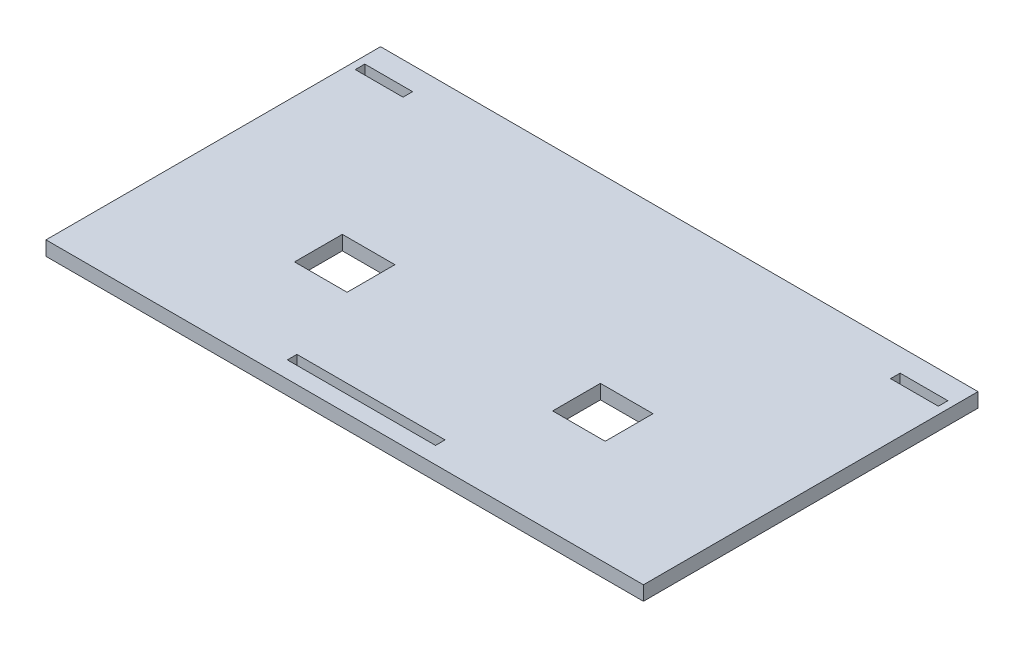
ISO-10303-21;
HEADER;
FILE_DESCRIPTION(('STEP AP214'),'2;1');
FILE_NAME('part.step','',(''),(''),'','','');
FILE_SCHEMA(('AUTOMOTIVE_DESIGN { 1 0 10303 214 1 1 1 1 }'));
ENDSEC;
DATA;
#1=APPLICATION_CONTEXT('core data for automotive mechanical design processes');
#2=APPLICATION_PROTOCOL_DEFINITION('international standard','automotive_design',2000,#1);
#3=PRODUCT_CONTEXT('',#1,'mechanical');
#4=PRODUCT('Part','Part','',(#3));
#5=PRODUCT_RELATED_PRODUCT_CATEGORY('part','',(#4));
#6=PRODUCT_DEFINITION_FORMATION('','',#4);
#7=PRODUCT_DEFINITION_CONTEXT('part definition',#1,'design');
#8=PRODUCT_DEFINITION('design','',#6,#7);
#9=PRODUCT_DEFINITION_SHAPE('','',#8);
#10=(LENGTH_UNIT() NAMED_UNIT(*) SI_UNIT(.MILLI.,.METRE.));
#11=(NAMED_UNIT(*) PLANE_ANGLE_UNIT() SI_UNIT($,.RADIAN.));
#12=(NAMED_UNIT(*) SI_UNIT($,.STERADIAN.) SOLID_ANGLE_UNIT());
#13=UNCERTAINTY_MEASURE_WITH_UNIT(LENGTH_MEASURE(1.E-05),#10,'distance_accuracy_value','');
#14=(GEOMETRIC_REPRESENTATION_CONTEXT(3) GLOBAL_UNCERTAINTY_ASSIGNED_CONTEXT((#13)) GLOBAL_UNIT_ASSIGNED_CONTEXT((#10,
#11,#12)) REPRESENTATION_CONTEXT('',''));
#15=CARTESIAN_POINT('',(0.,0.,0.));
#16=DIRECTION('',(0.,0.,1.));
#17=DIRECTION('',(1.,0.,0.));
#18=AXIS2_PLACEMENT_3D('',#15,#16,#17);
#19=CARTESIAN_POINT('',(-62.5,3.,-35.));
#20=DIRECTION('',(1.,0.,0.));
#21=DIRECTION('',(0.,0.,-1.));
#22=AXIS2_PLACEMENT_3D('',#19,#20,#21);
#23=PLANE('',#22);
#24=DIRECTION('',(0.,0.,1.));
#25=VECTOR('',#24,1.);
#26=CARTESIAN_POINT('',(-62.5,0.,-35.));
#27=LINE('',#26,#25);
#28=CARTESIAN_POINT('',(-62.5,0.,-35.));
#29=VERTEX_POINT('',#28);
#30=CARTESIAN_POINT('',(-62.5,0.,35.));
#31=VERTEX_POINT('',#30);
#32=EDGE_CURVE('E317',#29,#31,#27,.T.);
#33=ORIENTED_EDGE('',*,*,#32,.T.);
#34=DIRECTION('',(0.,-1.,0.));
#35=VECTOR('',#34,1.);
#36=CARTESIAN_POINT('',(-62.5,3.,35.));
#37=LINE('',#36,#35);
#38=CARTESIAN_POINT('',(-62.5,3.,35.));
#39=VERTEX_POINT('',#38);
#40=EDGE_CURVE('E390',#39,#31,#37,.T.);
#41=ORIENTED_EDGE('',*,*,#40,.F.);
#42=DIRECTION('',(0.,0.,1.));
#43=VECTOR('',#42,1.);
#44=CARTESIAN_POINT('',(-62.5,3.,-35.));
#45=LINE('',#44,#43);
#46=CARTESIAN_POINT('',(-62.5,3.,-35.));
#47=VERTEX_POINT('',#46);
#48=EDGE_CURVE('E353',#47,#39,#45,.T.);
#49=ORIENTED_EDGE('',*,*,#48,.F.);
#50=DIRECTION('',(0.,-1.,0.));
#51=VECTOR('',#50,1.);
#52=CARTESIAN_POINT('',(-62.5,3.,-35.));
#53=LINE('',#52,#51);
#54=EDGE_CURVE('E367',#47,#29,#53,.T.);
#55=ORIENTED_EDGE('',*,*,#54,.T.);
#56=EDGE_LOOP('',(#33,#41,#49,#55));
#57=FACE_BOUND('',#56,.T.);
#58=ADVANCED_FACE('F42',(#57),#23,.F.);
#59=CARTESIAN_POINT('',(62.5,3.,35.));
#60=DIRECTION('',(0.,0.,-1.));
#61=DIRECTION('',(-1.,0.,0.));
#62=AXIS2_PLACEMENT_3D('',#59,#60,#61);
#63=PLANE('',#62);
#64=DIRECTION('',(1.,0.,0.));
#65=VECTOR('',#64,1.);
#66=CARTESIAN_POINT('',(62.5,0.,35.));
#67=LINE('',#66,#65);
#68=CARTESIAN_POINT('',(62.5,0.,35.));
#69=VERTEX_POINT('',#68);
#70=EDGE_CURVE('E371',#31,#69,#67,.T.);
#71=ORIENTED_EDGE('',*,*,#70,.T.);
#72=DIRECTION('',(0.,-1.,0.));
#73=VECTOR('',#72,1.);
#74=CARTESIAN_POINT('',(62.5,3.,35.));
#75=LINE('',#74,#73);
#76=CARTESIAN_POINT('',(62.5,3.,35.));
#77=VERTEX_POINT('',#76);
#78=EDGE_CURVE('E386',#77,#69,#75,.T.);
#79=ORIENTED_EDGE('',*,*,#78,.F.);
#80=DIRECTION('',(1.,0.,0.));
#81=VECTOR('',#80,1.);
#82=CARTESIAN_POINT('',(62.5,3.,35.));
#83=LINE('',#82,#81);
#84=EDGE_CURVE('E357',#39,#77,#83,.T.);
#85=ORIENTED_EDGE('',*,*,#84,.F.);
#86=ORIENTED_EDGE('',*,*,#40,.T.);
#87=EDGE_LOOP('',(#71,#79,#85,#86));
#88=FACE_BOUND('',#87,.T.);
#89=ADVANCED_FACE('F475',(#88),#63,.F.);
#90=CARTESIAN_POINT('',(62.5,3.,-35.));
#91=DIRECTION('',(-1.,0.,0.));
#92=DIRECTION('',(0.,0.,1.));
#93=AXIS2_PLACEMENT_3D('',#90,#91,#92);
#94=PLANE('',#93);
#95=DIRECTION('',(0.,0.,-1.));
#96=VECTOR('',#95,1.);
#97=CARTESIAN_POINT('',(62.5,0.,-35.));
#98=LINE('',#97,#96);
#99=CARTESIAN_POINT('',(62.5,0.,-35.));
#100=VERTEX_POINT('',#99);
#101=EDGE_CURVE('E374',#69,#100,#98,.T.);
#102=ORIENTED_EDGE('',*,*,#101,.T.);
#103=DIRECTION('',(0.,-1.,0.));
#104=VECTOR('',#103,1.);
#105=CARTESIAN_POINT('',(62.5,3.,-35.));
#106=LINE('',#105,#104);
#107=CARTESIAN_POINT('',(62.5,3.,-35.));
#108=VERTEX_POINT('',#107);
#109=EDGE_CURVE('E382',#108,#100,#106,.T.);
#110=ORIENTED_EDGE('',*,*,#109,.F.);
#111=DIRECTION('',(0.,0.,-1.));
#112=VECTOR('',#111,1.);
#113=CARTESIAN_POINT('',(62.5,3.,-35.));
#114=LINE('',#113,#112);
#115=EDGE_CURVE('E361',#77,#108,#114,.T.);
#116=ORIENTED_EDGE('',*,*,#115,.F.);
#117=ORIENTED_EDGE('',*,*,#78,.T.);
#118=EDGE_LOOP('',(#102,#110,#116,#117));
#119=FACE_BOUND('',#118,.T.);
#120=ADVANCED_FACE('F480',(#119),#94,.F.);
#121=CARTESIAN_POINT('',(62.5,3.,-35.));
#122=DIRECTION('',(0.,0.,1.));
#123=DIRECTION('',(1.,0.,0.));
#124=AXIS2_PLACEMENT_3D('',#121,#122,#123);
#125=PLANE('',#124);
#126=DIRECTION('',(-1.,0.,0.));
#127=VECTOR('',#126,1.);
#128=CARTESIAN_POINT('',(62.5,0.,-35.));
#129=LINE('',#128,#127);
#130=EDGE_CURVE('E358',#100,#29,#129,.T.);
#131=ORIENTED_EDGE('',*,*,#130,.T.);
#132=ORIENTED_EDGE('',*,*,#54,.F.);
#133=DIRECTION('',(-1.,0.,0.));
#134=VECTOR('',#133,1.);
#135=CARTESIAN_POINT('',(62.5,3.,-35.));
#136=LINE('',#135,#134);
#137=EDGE_CURVE('E364',#108,#47,#136,.T.);
#138=ORIENTED_EDGE('',*,*,#137,.F.);
#139=ORIENTED_EDGE('',*,*,#109,.T.);
#140=EDGE_LOOP('',(#131,#132,#138,#139));
#141=FACE_BOUND('',#140,.T.);
#142=ADVANCED_FACE('F495',(#141),#125,.F.);
#143=CARTESIAN_POINT('',(0.,3.,0.));
#144=DIRECTION('',(0.,-1.,0.));
#145=DIRECTION('',(0.,0.,-1.));
#146=AXIS2_PLACEMENT_3D('',#143,#144,#145);
#147=PLANE('',#146);
#148=DIRECTION('',(1.,0.,0.));
#149=VECTOR('',#148,1.);
#150=CARTESIAN_POINT('',(-32.5,3.,13.));
#151=LINE('',#150,#149);
#152=CARTESIAN_POINT('',(-32.5,3.,13.));
#153=VERTEX_POINT('',#152);
#154=CARTESIAN_POINT('',(-21.5,3.,13.));
#155=VERTEX_POINT('',#154);
#156=EDGE_CURVE('E220',#153,#155,#151,.T.);
#157=ORIENTED_EDGE('',*,*,#156,.F.);
#158=DIRECTION('',(0.,0.,1.));
#159=VECTOR('',#158,1.);
#160=CARTESIAN_POINT('',(-32.5,3.,3.00000000000002));
#161=LINE('',#160,#159);
#162=CARTESIAN_POINT('',(-32.5,3.,3.00000000000002));
#163=VERTEX_POINT('',#162);
#164=EDGE_CURVE('E57',#163,#153,#161,.T.);
#165=ORIENTED_EDGE('',*,*,#164,.F.);
#166=DIRECTION('',(-1.,0.,0.));
#167=VECTOR('',#166,1.);
#168=CARTESIAN_POINT('',(-32.5,3.,3.00000000000002));
#169=LINE('',#168,#167);
#170=CARTESIAN_POINT('',(-21.5,3.,3.00000000000002));
#171=VERTEX_POINT('',#170);
#172=EDGE_CURVE('E228',#171,#163,#169,.T.);
#173=ORIENTED_EDGE('',*,*,#172,.F.);
#174=DIRECTION('',(0.,0.,-1.));
#175=VECTOR('',#174,1.);
#176=CARTESIAN_POINT('',(-21.5,3.,3.00000000000002));
#177=LINE('',#176,#175);
#178=EDGE_CURVE('E209',#155,#171,#177,.T.);
#179=ORIENTED_EDGE('',*,*,#178,.F.);
#180=EDGE_LOOP('',(#157,#165,#173,#179));
#181=FACE_BOUND('',#180,.T.);
#182=DIRECTION('',(0.,0.,-1.));
#183=VECTOR('',#182,1.);
#184=CARTESIAN_POINT('',(32.5,3.,3.00000000000002));
#185=LINE('',#184,#183);
#186=CARTESIAN_POINT('',(32.5,3.,13.));
#187=VERTEX_POINT('',#186);
#188=CARTESIAN_POINT('',(32.5,3.,3.00000000000002));
#189=VERTEX_POINT('',#188);
#190=EDGE_CURVE('E263',#187,#189,#185,.T.);
#191=ORIENTED_EDGE('',*,*,#190,.F.);
#192=DIRECTION('',(1.,0.,0.));
#193=VECTOR('',#192,1.);
#194=CARTESIAN_POINT('',(21.5,3.,13.));
#195=LINE('',#194,#193);
#196=CARTESIAN_POINT('',(21.5,3.,13.));
#197=VERTEX_POINT('',#196);
#198=EDGE_CURVE('E65',#197,#187,#195,.T.);
#199=ORIENTED_EDGE('',*,*,#198,.F.);
#200=DIRECTION('',(0.,0.,1.));
#201=VECTOR('',#200,1.);
#202=CARTESIAN_POINT('',(21.5,3.,3.00000000000002));
#203=LINE('',#202,#201);
#204=CARTESIAN_POINT('',(21.5,3.,3.00000000000002));
#205=VERTEX_POINT('',#204);
#206=EDGE_CURVE('E246',#205,#197,#203,.T.);
#207=ORIENTED_EDGE('',*,*,#206,.F.);
#208=DIRECTION('',(-1.,0.,0.));
#209=VECTOR('',#208,1.);
#210=CARTESIAN_POINT('',(21.5,3.,3.00000000000002));
#211=LINE('',#210,#209);
#212=EDGE_CURVE('E259',#189,#205,#211,.T.);
#213=ORIENTED_EDGE('',*,*,#212,.F.);
#214=EDGE_LOOP('',(#191,#199,#207,#213));
#215=FACE_BOUND('',#214,.T.);
#216=DIRECTION('',(1.,0.,0.));
#217=VECTOR('',#216,1.);
#218=CARTESIAN_POINT('',(-15.5,3.,31.5));
#219=LINE('',#218,#217);
#220=CARTESIAN_POINT('',(-15.5,3.,31.5));
#221=VERTEX_POINT('',#220);
#222=CARTESIAN_POINT('',(15.5,3.,31.5));
#223=VERTEX_POINT('',#222);
#224=EDGE_CURVE('E271',#221,#223,#219,.T.);
#225=ORIENTED_EDGE('',*,*,#224,.F.);
#226=DIRECTION('',(0.,0.,1.));
#227=VECTOR('',#226,1.);
#228=CARTESIAN_POINT('',(-15.5,3.,29.5));
#229=LINE('',#228,#227);
#230=CARTESIAN_POINT('',(-15.5,3.,29.5));
#231=VERTEX_POINT('',#230);
#232=EDGE_CURVE('E238',#231,#221,#229,.T.);
#233=ORIENTED_EDGE('',*,*,#232,.F.);
#234=DIRECTION('',(-1.,0.,0.));
#235=VECTOR('',#234,1.);
#236=CARTESIAN_POINT('',(-15.5,3.,29.5));
#237=LINE('',#236,#235);
#238=CARTESIAN_POINT('',(15.5,3.,29.5));
#239=VERTEX_POINT('',#238);
#240=EDGE_CURVE('E279',#239,#231,#237,.T.);
#241=ORIENTED_EDGE('',*,*,#240,.F.);
#242=DIRECTION('',(0.,0.,-1.));
#243=VECTOR('',#242,1.);
#244=CARTESIAN_POINT('',(15.5,3.,31.5));
#245=LINE('',#244,#243);
#246=EDGE_CURVE('E275',#223,#239,#245,.T.);
#247=ORIENTED_EDGE('',*,*,#246,.F.);
#248=EDGE_LOOP('',(#225,#233,#241,#247));
#249=FACE_BOUND('',#248,.T.);
#250=DIRECTION('',(1.,0.,0.));
#251=VECTOR('',#250,1.);
#252=CARTESIAN_POINT('',(-61.,3.,-28.2));
#253=LINE('',#252,#251);
#254=CARTESIAN_POINT('',(-61.,3.,-28.2));
#255=VERTEX_POINT('',#254);
#256=CARTESIAN_POINT('',(-51.,3.,-28.2));
#257=VERTEX_POINT('',#256);
#258=EDGE_CURVE('E300',#255,#257,#253,.T.);
#259=ORIENTED_EDGE('',*,*,#258,.F.);
#260=DIRECTION('',(0.,0.,1.));
#261=VECTOR('',#260,1.);
#262=CARTESIAN_POINT('',(-61.,3.,-30.2));
#263=LINE('',#262,#261);
#264=CARTESIAN_POINT('',(-61.,3.,-30.2));
#265=VERTEX_POINT('',#264);
#266=EDGE_CURVE('E297',#265,#255,#263,.T.);
#267=ORIENTED_EDGE('',*,*,#266,.F.);
#268=DIRECTION('',(-1.,0.,0.));
#269=VECTOR('',#268,1.);
#270=CARTESIAN_POINT('',(-61.,3.,-30.2));
#271=LINE('',#270,#269);
#272=CARTESIAN_POINT('',(-51.,3.,-30.2));
#273=VERTEX_POINT('',#272);
#274=EDGE_CURVE('E309',#273,#265,#271,.T.);
#275=ORIENTED_EDGE('',*,*,#274,.F.);
#276=DIRECTION('',(0.,0.,-1.));
#277=VECTOR('',#276,1.);
#278=CARTESIAN_POINT('',(-51.,3.,-30.2));
#279=LINE('',#278,#277);
#280=EDGE_CURVE('E305',#257,#273,#279,.T.);
#281=ORIENTED_EDGE('',*,*,#280,.F.);
#282=EDGE_LOOP('',(#259,#267,#275,#281));
#283=FACE_BOUND('',#282,.T.);
#284=DIRECTION('',(0.,0.,-1.));
#285=VECTOR('',#284,1.);
#286=CARTESIAN_POINT('',(61.,3.,-30.2));
#287=LINE('',#286,#285);
#288=CARTESIAN_POINT('',(61.,3.,-28.2));
#289=VERTEX_POINT('',#288);
#290=CARTESIAN_POINT('',(61.,3.,-30.2));
#291=VERTEX_POINT('',#290);
#292=EDGE_CURVE('E347',#289,#291,#287,.T.);
#293=ORIENTED_EDGE('',*,*,#292,.F.);
#294=DIRECTION('',(1.,0.,0.));
#295=VECTOR('',#294,1.);
#296=CARTESIAN_POINT('',(51.,3.,-28.2));
#297=LINE('',#296,#295);
#298=CARTESIAN_POINT('',(51.,3.,-28.2));
#299=VERTEX_POINT('',#298);
#300=EDGE_CURVE('E301',#299,#289,#297,.T.);
#301=ORIENTED_EDGE('',*,*,#300,.F.);
#302=DIRECTION('',(0.,0.,1.));
#303=VECTOR('',#302,1.);
#304=CARTESIAN_POINT('',(51.,3.,-30.2));
#305=LINE('',#304,#303);
#306=CARTESIAN_POINT('',(51.,3.,-30.2));
#307=VERTEX_POINT('',#306);
#308=EDGE_CURVE('E331',#307,#299,#305,.T.);
#309=ORIENTED_EDGE('',*,*,#308,.F.);
#310=DIRECTION('',(-1.,0.,0.));
#311=VECTOR('',#310,1.);
#312=CARTESIAN_POINT('',(51.,3.,-30.2));
#313=LINE('',#312,#311);
#314=EDGE_CURVE('E343',#291,#307,#313,.T.);
#315=ORIENTED_EDGE('',*,*,#314,.F.);
#316=EDGE_LOOP('',(#293,#301,#309,#315));
#317=FACE_BOUND('',#316,.T.);
#318=ORIENTED_EDGE('',*,*,#48,.T.);
#319=ORIENTED_EDGE('',*,*,#84,.T.);
#320=ORIENTED_EDGE('',*,*,#115,.T.);
#321=ORIENTED_EDGE('',*,*,#137,.T.);
#322=EDGE_LOOP('',(#318,#319,#320,#321));
#323=FACE_BOUND('',#322,.T.);
#324=ADVANCED_FACE('F225',(#181,#215,#249,#283,#317,#323),#147,.F.);
#325=CARTESIAN_POINT('',(0.,0.,0.));
#326=DIRECTION('',(0.,-1.,0.));
#327=DIRECTION('',(0.,0.,-1.));
#328=AXIS2_PLACEMENT_3D('',#325,#326,#327);
#329=PLANE('',#328);
#330=DIRECTION('',(0.,0.,-1.));
#331=VECTOR('',#330,1.);
#332=CARTESIAN_POINT('',(-32.5,0.,0.));
#333=LINE('',#332,#331);
#334=CARTESIAN_POINT('',(-32.5,0.,13.));
#335=VERTEX_POINT('',#334);
#336=CARTESIAN_POINT('',(-32.5,0.,3.00000000000002));
#337=VERTEX_POINT('',#336);
#338=EDGE_CURVE('E11',#335,#337,#333,.T.);
#339=ORIENTED_EDGE('',*,*,#338,.F.);
#340=DIRECTION('',(-1.,0.,0.));
#341=VECTOR('',#340,1.);
#342=CARTESIAN_POINT('',(0.,0.,13.));
#343=LINE('',#342,#341);
#344=CARTESIAN_POINT('',(-21.5,0.,13.));
#345=VERTEX_POINT('',#344);
#346=EDGE_CURVE('E446',#345,#335,#343,.T.);
#347=ORIENTED_EDGE('',*,*,#346,.F.);
#348=DIRECTION('',(0.,0.,1.));
#349=VECTOR('',#348,1.);
#350=CARTESIAN_POINT('',(-21.5,0.,0.));
#351=LINE('',#350,#349);
#352=CARTESIAN_POINT('',(-21.5,0.,3.00000000000002));
#353=VERTEX_POINT('',#352);
#354=EDGE_CURVE('E212',#353,#345,#351,.T.);
#355=ORIENTED_EDGE('',*,*,#354,.F.);
#356=DIRECTION('',(1.,0.,0.));
#357=VECTOR('',#356,1.);
#358=CARTESIAN_POINT('',(0.,0.,3.00000000000002));
#359=LINE('',#358,#357);
#360=EDGE_CURVE('E50',#337,#353,#359,.T.);
#361=ORIENTED_EDGE('',*,*,#360,.F.);
#362=EDGE_LOOP('',(#339,#347,#355,#361));
#363=FACE_BOUND('',#362,.T.);
#364=DIRECTION('',(-1.,0.,0.));
#365=VECTOR('',#364,1.);
#366=CARTESIAN_POINT('',(0.,0.,13.));
#367=LINE('',#366,#365);
#368=CARTESIAN_POINT('',(32.5,0.,13.));
#369=VERTEX_POINT('',#368);
#370=CARTESIAN_POINT('',(21.5,0.,13.));
#371=VERTEX_POINT('',#370);
#372=EDGE_CURVE('E443',#369,#371,#367,.T.);
#373=ORIENTED_EDGE('',*,*,#372,.F.);
#374=DIRECTION('',(0.,0.,1.));
#375=VECTOR('',#374,1.);
#376=CARTESIAN_POINT('',(32.5,0.,0.));
#377=LINE('',#376,#375);
#378=CARTESIAN_POINT('',(32.5,0.,3.00000000000002));
#379=VERTEX_POINT('',#378);
#380=EDGE_CURVE('E433',#379,#369,#377,.T.);
#381=ORIENTED_EDGE('',*,*,#380,.F.);
#382=DIRECTION('',(1.,0.,0.));
#383=VECTOR('',#382,1.);
#384=CARTESIAN_POINT('',(0.,0.,3.00000000000002));
#385=LINE('',#384,#383);
#386=CARTESIAN_POINT('',(21.5,0.,3.00000000000002));
#387=VERTEX_POINT('',#386);
#388=EDGE_CURVE('E436',#387,#379,#385,.T.);
#389=ORIENTED_EDGE('',*,*,#388,.F.);
#390=DIRECTION('',(0.,0.,-1.));
#391=VECTOR('',#390,1.);
#392=CARTESIAN_POINT('',(21.5,0.,0.));
#393=LINE('',#392,#391);
#394=EDGE_CURVE('E440',#371,#387,#393,.T.);
#395=ORIENTED_EDGE('',*,*,#394,.F.);
#396=EDGE_LOOP('',(#373,#381,#389,#395));
#397=FACE_BOUND('',#396,.T.);
#398=DIRECTION('',(0.,0.,-1.));
#399=VECTOR('',#398,1.);
#400=CARTESIAN_POINT('',(-15.5,0.,0.));
#401=LINE('',#400,#399);
#402=CARTESIAN_POINT('',(-15.5,0.,31.5));
#403=VERTEX_POINT('',#402);
#404=CARTESIAN_POINT('',(-15.5,0.,29.5));
#405=VERTEX_POINT('',#404);
#406=EDGE_CURVE('E430',#403,#405,#401,.T.);
#407=ORIENTED_EDGE('',*,*,#406,.F.);
#408=DIRECTION('',(-1.,0.,0.));
#409=VECTOR('',#408,1.);
#410=CARTESIAN_POINT('',(0.,0.,31.5));
#411=LINE('',#410,#409);
#412=CARTESIAN_POINT('',(15.5,0.,31.5));
#413=VERTEX_POINT('',#412);
#414=EDGE_CURVE('E420',#413,#403,#411,.T.);
#415=ORIENTED_EDGE('',*,*,#414,.F.);
#416=DIRECTION('',(0.,0.,1.));
#417=VECTOR('',#416,1.);
#418=CARTESIAN_POINT('',(15.5,0.,0.));
#419=LINE('',#418,#417);
#420=CARTESIAN_POINT('',(15.5,0.,29.5));
#421=VERTEX_POINT('',#420);
#422=EDGE_CURVE('E423',#421,#413,#419,.T.);
#423=ORIENTED_EDGE('',*,*,#422,.F.);
#424=DIRECTION('',(1.,0.,0.));
#425=VECTOR('',#424,1.);
#426=CARTESIAN_POINT('',(0.,0.,29.5));
#427=LINE('',#426,#425);
#428=EDGE_CURVE('E427',#405,#421,#427,.T.);
#429=ORIENTED_EDGE('',*,*,#428,.F.);
#430=EDGE_LOOP('',(#407,#415,#423,#429));
#431=FACE_BOUND('',#430,.T.);
#432=DIRECTION('',(0.,0.,-1.));
#433=VECTOR('',#432,1.);
#434=CARTESIAN_POINT('',(-61.,0.,0.));
#435=LINE('',#434,#433);
#436=CARTESIAN_POINT('',(-61.,0.,-28.2));
#437=VERTEX_POINT('',#436);
#438=CARTESIAN_POINT('',(-61.,0.,-30.2));
#439=VERTEX_POINT('',#438);
#440=EDGE_CURVE('E417',#437,#439,#435,.T.);
#441=ORIENTED_EDGE('',*,*,#440,.F.);
#442=DIRECTION('',(-1.,0.,0.));
#443=VECTOR('',#442,1.);
#444=CARTESIAN_POINT('',(0.,0.,-28.2));
#445=LINE('',#444,#443);
#446=CARTESIAN_POINT('',(-51.,0.,-28.2));
#447=VERTEX_POINT('',#446);
#448=EDGE_CURVE('E407',#447,#437,#445,.T.);
#449=ORIENTED_EDGE('',*,*,#448,.F.);
#450=DIRECTION('',(0.,0.,1.));
#451=VECTOR('',#450,1.);
#452=CARTESIAN_POINT('',(-51.0000000000001,0.,-1.76941794549635E-13));
#453=LINE('',#452,#451);
#454=CARTESIAN_POINT('',(-51.,0.,-30.2));
#455=VERTEX_POINT('',#454);
#456=EDGE_CURVE('E410',#455,#447,#453,.T.);
#457=ORIENTED_EDGE('',*,*,#456,.F.);
#458=DIRECTION('',(1.,0.,0.));
#459=VECTOR('',#458,1.);
#460=CARTESIAN_POINT('',(0.,0.,-30.2));
#461=LINE('',#460,#459);
#462=EDGE_CURVE('E414',#439,#455,#461,.T.);
#463=ORIENTED_EDGE('',*,*,#462,.F.);
#464=EDGE_LOOP('',(#441,#449,#457,#463));
#465=FACE_BOUND('',#464,.T.);
#466=DIRECTION('',(-1.,0.,0.));
#467=VECTOR('',#466,1.);
#468=CARTESIAN_POINT('',(0.,0.,-28.2));
#469=LINE('',#468,#467);
#470=CARTESIAN_POINT('',(61.,0.,-28.2));
#471=VERTEX_POINT('',#470);
#472=CARTESIAN_POINT('',(51.,0.,-28.2));
#473=VERTEX_POINT('',#472);
#474=EDGE_CURVE('E404',#471,#473,#469,.T.);
#475=ORIENTED_EDGE('',*,*,#474,.F.);
#476=DIRECTION('',(0.,0.,1.));
#477=VECTOR('',#476,1.);
#478=CARTESIAN_POINT('',(61.,0.,0.));
#479=LINE('',#478,#477);
#480=CARTESIAN_POINT('',(61.,0.,-30.2));
#481=VERTEX_POINT('',#480);
#482=EDGE_CURVE('E394',#481,#471,#479,.T.);
#483=ORIENTED_EDGE('',*,*,#482,.F.);
#484=DIRECTION('',(1.,0.,0.));
#485=VECTOR('',#484,1.);
#486=CARTESIAN_POINT('',(0.,0.,-30.2));
#487=LINE('',#486,#485);
#488=CARTESIAN_POINT('',(51.,0.,-30.2));
#489=VERTEX_POINT('',#488);
#490=EDGE_CURVE('E397',#489,#481,#487,.T.);
#491=ORIENTED_EDGE('',*,*,#490,.F.);
#492=DIRECTION('',(0.,0.,-1.));
#493=VECTOR('',#492,1.);
#494=CARTESIAN_POINT('',(50.9999999999999,0.,1.76941794549634E-13));
#495=LINE('',#494,#493);
#496=EDGE_CURVE('E401',#473,#489,#495,.T.);
#497=ORIENTED_EDGE('',*,*,#496,.F.);
#498=EDGE_LOOP('',(#475,#483,#491,#497));
#499=FACE_BOUND('',#498,.T.);
#500=ORIENTED_EDGE('',*,*,#32,.F.);
#501=ORIENTED_EDGE('',*,*,#130,.F.);
#502=ORIENTED_EDGE('',*,*,#101,.F.);
#503=ORIENTED_EDGE('',*,*,#70,.F.);
#504=EDGE_LOOP('',(#500,#501,#502,#503));
#505=FACE_BOUND('',#504,.T.);
#506=ADVANCED_FACE('F457',(#363,#397,#431,#465,#499,#505),#329,.T.);
#507=CARTESIAN_POINT('',(51.,-7.,-28.2));
#508=DIRECTION('',(0.,0.,1.));
#509=DIRECTION('',(1.,0.,0.));
#510=AXIS2_PLACEMENT_3D('',#507,#508,#509);
#511=PLANE('',#510);
#512=ORIENTED_EDGE('',*,*,#474,.T.);
#513=DIRECTION('',(0.,1.,0.));
#514=VECTOR('',#513,1.);
#515=CARTESIAN_POINT('',(51.,-7.,-28.2));
#516=LINE('',#515,#514);
#517=EDGE_CURVE('E287',#473,#299,#516,.T.);
#518=ORIENTED_EDGE('',*,*,#517,.T.);
#519=ORIENTED_EDGE('',*,*,#300,.T.);
#520=DIRECTION('',(0.,1.,0.));
#521=VECTOR('',#520,1.);
#522=CARTESIAN_POINT('',(61.,-7.,-28.2));
#523=LINE('',#522,#521);
#524=EDGE_CURVE('E327',#471,#289,#523,.T.);
#525=ORIENTED_EDGE('',*,*,#524,.F.);
#526=EDGE_LOOP('',(#512,#518,#519,#525));
#527=FACE_BOUND('',#526,.T.);
#528=ADVANCED_FACE('F506',(#527),#511,.F.);
#529=CARTESIAN_POINT('',(51.,-7.,-30.2));
#530=DIRECTION('',(-1.,0.,0.));
#531=DIRECTION('',(0.,0.,1.));
#532=AXIS2_PLACEMENT_3D('',#529,#530,#531);
#533=PLANE('',#532);
#534=ORIENTED_EDGE('',*,*,#496,.T.);
#535=DIRECTION('',(0.,1.,0.));
#536=VECTOR('',#535,1.);
#537=CARTESIAN_POINT('',(51.,-7.,-30.2));
#538=LINE('',#537,#536);
#539=EDGE_CURVE('E335',#489,#307,#538,.T.);
#540=ORIENTED_EDGE('',*,*,#539,.T.);
#541=ORIENTED_EDGE('',*,*,#308,.T.);
#542=ORIENTED_EDGE('',*,*,#517,.F.);
#543=EDGE_LOOP('',(#534,#540,#541,#542));
#544=FACE_BOUND('',#543,.T.);
#545=ADVANCED_FACE('F509',(#544),#533,.F.);
#546=CARTESIAN_POINT('',(51.,-7.,-30.2));
#547=DIRECTION('',(0.,0.,-1.));
#548=DIRECTION('',(-1.,0.,0.));
#549=AXIS2_PLACEMENT_3D('',#546,#547,#548);
#550=PLANE('',#549);
#551=ORIENTED_EDGE('',*,*,#490,.T.);
#552=DIRECTION('',(0.,1.,0.));
#553=VECTOR('',#552,1.);
#554=CARTESIAN_POINT('',(61.,-7.,-30.2));
#555=LINE('',#554,#553);
#556=EDGE_CURVE('E332',#481,#291,#555,.T.);
#557=ORIENTED_EDGE('',*,*,#556,.T.);
#558=ORIENTED_EDGE('',*,*,#314,.T.);
#559=ORIENTED_EDGE('',*,*,#539,.F.);
#560=EDGE_LOOP('',(#551,#557,#558,#559));
#561=FACE_BOUND('',#560,.T.);
#562=ADVANCED_FACE('F512',(#561),#550,.F.);
#563=CARTESIAN_POINT('',(61.,-7.,-30.2));
#564=DIRECTION('',(1.,0.,0.));
#565=DIRECTION('',(0.,0.,-1.));
#566=AXIS2_PLACEMENT_3D('',#563,#564,#565);
#567=PLANE('',#566);
#568=ORIENTED_EDGE('',*,*,#482,.T.);
#569=ORIENTED_EDGE('',*,*,#524,.T.);
#570=ORIENTED_EDGE('',*,*,#292,.T.);
#571=ORIENTED_EDGE('',*,*,#556,.F.);
#572=EDGE_LOOP('',(#568,#569,#570,#571));
#573=FACE_BOUND('',#572,.T.);
#574=ADVANCED_FACE('F516',(#573),#567,.F.);
#575=CARTESIAN_POINT('',(-61.,-7.,-30.2));
#576=DIRECTION('',(-1.,0.,0.));
#577=DIRECTION('',(0.,0.,1.));
#578=AXIS2_PLACEMENT_3D('',#575,#576,#577);
#579=PLANE('',#578);
#580=ORIENTED_EDGE('',*,*,#440,.T.);
#581=DIRECTION('',(0.,1.,0.));
#582=VECTOR('',#581,1.);
#583=CARTESIAN_POINT('',(-61.,-7.,-30.2));
#584=LINE('',#583,#582);
#585=EDGE_CURVE('E314',#439,#265,#584,.T.);
#586=ORIENTED_EDGE('',*,*,#585,.T.);
#587=ORIENTED_EDGE('',*,*,#266,.T.);
#588=DIRECTION('',(0.,1.,0.));
#589=VECTOR('',#588,1.);
#590=CARTESIAN_POINT('',(-61.,-7.,-28.2));
#591=LINE('',#590,#589);
#592=EDGE_CURVE('E313',#437,#255,#591,.T.);
#593=ORIENTED_EDGE('',*,*,#592,.F.);
#594=EDGE_LOOP('',(#580,#586,#587,#593));
#595=FACE_BOUND('',#594,.T.);
#596=ADVANCED_FACE('F520',(#595),#579,.F.);
#597=CARTESIAN_POINT('',(-61.,-7.,-30.2));
#598=DIRECTION('',(0.,0.,-1.));
#599=DIRECTION('',(-1.,0.,0.));
#600=AXIS2_PLACEMENT_3D('',#597,#598,#599);
#601=PLANE('',#600);
#602=ORIENTED_EDGE('',*,*,#462,.T.);
#603=DIRECTION('',(0.,1.,0.));
#604=VECTOR('',#603,1.);
#605=CARTESIAN_POINT('',(-51.,-7.,-30.2));
#606=LINE('',#605,#604);
#607=EDGE_CURVE('E318',#455,#273,#606,.T.);
#608=ORIENTED_EDGE('',*,*,#607,.T.);
#609=ORIENTED_EDGE('',*,*,#274,.T.);
#610=ORIENTED_EDGE('',*,*,#585,.F.);
#611=EDGE_LOOP('',(#602,#608,#609,#610));
#612=FACE_BOUND('',#611,.T.);
#613=ADVANCED_FACE('F527',(#612),#601,.F.);
#614=CARTESIAN_POINT('',(-51.,-7.,-30.2));
#615=DIRECTION('',(1.,0.,0.));
#616=DIRECTION('',(0.,0.,-1.));
#617=AXIS2_PLACEMENT_3D('',#614,#615,#616);
#618=PLANE('',#617);
#619=ORIENTED_EDGE('',*,*,#456,.T.);
#620=DIRECTION('',(0.,1.,0.));
#621=VECTOR('',#620,1.);
#622=CARTESIAN_POINT('',(-51.,-7.,-28.2));
#623=LINE('',#622,#621);
#624=EDGE_CURVE('E321',#447,#257,#623,.T.);
#625=ORIENTED_EDGE('',*,*,#624,.T.);
#626=ORIENTED_EDGE('',*,*,#280,.T.);
#627=ORIENTED_EDGE('',*,*,#607,.F.);
#628=EDGE_LOOP('',(#619,#625,#626,#627));
#629=FACE_BOUND('',#628,.T.);
#630=ADVANCED_FACE('F533',(#629),#618,.F.);
#631=CARTESIAN_POINT('',(-61.,-7.,-28.2));
#632=DIRECTION('',(0.,0.,1.));
#633=DIRECTION('',(1.,0.,0.));
#634=AXIS2_PLACEMENT_3D('',#631,#632,#633);
#635=PLANE('',#634);
#636=ORIENTED_EDGE('',*,*,#448,.T.);
#637=ORIENTED_EDGE('',*,*,#592,.T.);
#638=ORIENTED_EDGE('',*,*,#258,.T.);
#639=ORIENTED_EDGE('',*,*,#624,.F.);
#640=EDGE_LOOP('',(#636,#637,#638,#639));
#641=FACE_BOUND('',#640,.T.);
#642=ADVANCED_FACE('F529',(#641),#635,.F.);
#643=CARTESIAN_POINT('',(-15.5,-7.,29.5));
#644=DIRECTION('',(-1.,0.,0.));
#645=DIRECTION('',(0.,0.,1.));
#646=AXIS2_PLACEMENT_3D('',#643,#644,#645);
#647=PLANE('',#646);
#648=ORIENTED_EDGE('',*,*,#406,.T.);
#649=DIRECTION('',(0.,1.,0.));
#650=VECTOR('',#649,1.);
#651=CARTESIAN_POINT('',(-15.5,-7.,29.5));
#652=LINE('',#651,#650);
#653=EDGE_CURVE('E284',#405,#231,#652,.T.);
#654=ORIENTED_EDGE('',*,*,#653,.T.);
#655=ORIENTED_EDGE('',*,*,#232,.T.);
#656=DIRECTION('',(0.,1.,0.));
#657=VECTOR('',#656,1.);
#658=CARTESIAN_POINT('',(-15.5,-7.,31.5));
#659=LINE('',#658,#657);
#660=EDGE_CURVE('E283',#403,#221,#659,.T.);
#661=ORIENTED_EDGE('',*,*,#660,.F.);
#662=EDGE_LOOP('',(#648,#654,#655,#661));
#663=FACE_BOUND('',#662,.T.);
#664=ADVANCED_FACE('F532',(#663),#647,.F.);
#665=CARTESIAN_POINT('',(-15.5,-7.,29.5));
#666=DIRECTION('',(0.,0.,-1.));
#667=DIRECTION('',(-1.,0.,0.));
#668=AXIS2_PLACEMENT_3D('',#665,#666,#667);
#669=PLANE('',#668);
#670=ORIENTED_EDGE('',*,*,#428,.T.);
#671=DIRECTION('',(0.,1.,0.));
#672=VECTOR('',#671,1.);
#673=CARTESIAN_POINT('',(15.5,-7.,29.5));
#674=LINE('',#673,#672);
#675=EDGE_CURVE('E288',#421,#239,#674,.T.);
#676=ORIENTED_EDGE('',*,*,#675,.T.);
#677=ORIENTED_EDGE('',*,*,#240,.T.);
#678=ORIENTED_EDGE('',*,*,#653,.F.);
#679=EDGE_LOOP('',(#670,#676,#677,#678));
#680=FACE_BOUND('',#679,.T.);
#681=ADVANCED_FACE('F543',(#680),#669,.F.);
#682=CARTESIAN_POINT('',(15.5,-7.,31.5));
#683=DIRECTION('',(1.,0.,0.));
#684=DIRECTION('',(0.,0.,-1.));
#685=AXIS2_PLACEMENT_3D('',#682,#683,#684);
#686=PLANE('',#685);
#687=ORIENTED_EDGE('',*,*,#422,.T.);
#688=DIRECTION('',(0.,1.,0.));
#689=VECTOR('',#688,1.);
#690=CARTESIAN_POINT('',(15.5,-7.,31.5));
#691=LINE('',#690,#689);
#692=EDGE_CURVE('E291',#413,#223,#691,.T.);
#693=ORIENTED_EDGE('',*,*,#692,.T.);
#694=ORIENTED_EDGE('',*,*,#246,.T.);
#695=ORIENTED_EDGE('',*,*,#675,.F.);
#696=EDGE_LOOP('',(#687,#693,#694,#695));
#697=FACE_BOUND('',#696,.T.);
#698=ADVANCED_FACE('F549',(#697),#686,.F.);
#699=CARTESIAN_POINT('',(-15.5,-7.,31.5));
#700=DIRECTION('',(0.,0.,1.));
#701=DIRECTION('',(1.,0.,0.));
#702=AXIS2_PLACEMENT_3D('',#699,#700,#701);
#703=PLANE('',#702);
#704=ORIENTED_EDGE('',*,*,#414,.T.);
#705=ORIENTED_EDGE('',*,*,#660,.T.);
#706=ORIENTED_EDGE('',*,*,#224,.T.);
#707=ORIENTED_EDGE('',*,*,#692,.F.);
#708=EDGE_LOOP('',(#704,#705,#706,#707));
#709=FACE_BOUND('',#708,.T.);
#710=ADVANCED_FACE('F545',(#709),#703,.F.);
#711=CARTESIAN_POINT('',(21.5,-7.,13.));
#712=DIRECTION('',(0.,0.,1.));
#713=DIRECTION('',(1.,0.,0.));
#714=AXIS2_PLACEMENT_3D('',#711,#712,#713);
#715=PLANE('',#714);
#716=ORIENTED_EDGE('',*,*,#372,.T.);
#717=DIRECTION('',(0.,1.,0.));
#718=VECTOR('',#717,1.);
#719=CARTESIAN_POINT('',(21.5,-7.,13.));
#720=LINE('',#719,#718);
#721=EDGE_CURVE('E253',#371,#197,#720,.T.);
#722=ORIENTED_EDGE('',*,*,#721,.T.);
#723=ORIENTED_EDGE('',*,*,#198,.T.);
#724=DIRECTION('',(0.,1.,0.));
#725=VECTOR('',#724,1.);
#726=CARTESIAN_POINT('',(32.5,-7.,13.));
#727=LINE('',#726,#725);
#728=EDGE_CURVE('E243',#369,#187,#727,.T.);
#729=ORIENTED_EDGE('',*,*,#728,.F.);
#730=EDGE_LOOP('',(#716,#722,#723,#729));
#731=FACE_BOUND('',#730,.T.);
#732=ADVANCED_FACE('F548',(#731),#715,.F.);
#733=CARTESIAN_POINT('',(21.5,-7.,3.00000000000002));
#734=DIRECTION('',(-1.,0.,0.));
#735=DIRECTION('',(0.,0.,1.));
#736=AXIS2_PLACEMENT_3D('',#733,#734,#735);
#737=PLANE('',#736);
#738=ORIENTED_EDGE('',*,*,#394,.T.);
#739=DIRECTION('',(0.,1.,0.));
#740=VECTOR('',#739,1.);
#741=CARTESIAN_POINT('',(21.5,-7.,3.00000000000002));
#742=LINE('',#741,#740);
#743=EDGE_CURVE('E250',#387,#205,#742,.T.);
#744=ORIENTED_EDGE('',*,*,#743,.T.);
#745=ORIENTED_EDGE('',*,*,#206,.T.);
#746=ORIENTED_EDGE('',*,*,#721,.F.);
#747=EDGE_LOOP('',(#738,#744,#745,#746));
#748=FACE_BOUND('',#747,.T.);
#749=ADVANCED_FACE('F557',(#748),#737,.F.);
#750=CARTESIAN_POINT('',(21.5,-7.,3.00000000000002));
#751=DIRECTION('',(0.,0.,-1.));
#752=DIRECTION('',(-1.,0.,0.));
#753=AXIS2_PLACEMENT_3D('',#750,#751,#752);
#754=PLANE('',#753);
#755=ORIENTED_EDGE('',*,*,#388,.T.);
#756=DIRECTION('',(0.,1.,0.));
#757=VECTOR('',#756,1.);
#758=CARTESIAN_POINT('',(32.5,-7.,3.00000000000002));
#759=LINE('',#758,#757);
#760=EDGE_CURVE('E247',#379,#189,#759,.T.);
#761=ORIENTED_EDGE('',*,*,#760,.T.);
#762=ORIENTED_EDGE('',*,*,#212,.T.);
#763=ORIENTED_EDGE('',*,*,#743,.F.);
#764=EDGE_LOOP('',(#755,#761,#762,#763));
#765=FACE_BOUND('',#764,.T.);
#766=ADVANCED_FACE('F469',(#765),#754,.F.);
#767=CARTESIAN_POINT('',(32.5,-7.,3.00000000000002));
#768=DIRECTION('',(1.,0.,0.));
#769=DIRECTION('',(0.,0.,-1.));
#770=AXIS2_PLACEMENT_3D('',#767,#768,#769);
#771=PLANE('',#770);
#772=ORIENTED_EDGE('',*,*,#380,.T.);
#773=ORIENTED_EDGE('',*,*,#728,.T.);
#774=ORIENTED_EDGE('',*,*,#190,.T.);
#775=ORIENTED_EDGE('',*,*,#760,.F.);
#776=EDGE_LOOP('',(#772,#773,#774,#775));
#777=FACE_BOUND('',#776,.T.);
#778=ADVANCED_FACE('F462',(#777),#771,.F.);
#779=CARTESIAN_POINT('',(-32.5,-7.,3.00000000000002));
#780=DIRECTION('',(-1.,0.,0.));
#781=DIRECTION('',(0.,0.,1.));
#782=AXIS2_PLACEMENT_3D('',#779,#780,#781);
#783=PLANE('',#782);
#784=ORIENTED_EDGE('',*,*,#338,.T.);
#785=DIRECTION('',(0.,1.,0.));
#786=VECTOR('',#785,1.);
#787=CARTESIAN_POINT('',(-32.5,-7.,3.00000000000002));
#788=LINE('',#787,#786);
#789=EDGE_CURVE('E235',#337,#163,#788,.T.);
#790=ORIENTED_EDGE('',*,*,#789,.T.);
#791=ORIENTED_EDGE('',*,*,#164,.T.);
#792=DIRECTION('',(0.,1.,0.));
#793=VECTOR('',#792,1.);
#794=CARTESIAN_POINT('',(-32.5,-7.,13.));
#795=LINE('',#794,#793);
#796=EDGE_CURVE('E217',#335,#153,#795,.T.);
#797=ORIENTED_EDGE('',*,*,#796,.F.);
#798=EDGE_LOOP('',(#784,#790,#791,#797));
#799=FACE_BOUND('',#798,.T.);
#800=ADVANCED_FACE('F459',(#799),#783,.F.);
#801=CARTESIAN_POINT('',(-32.5,-7.,3.00000000000002));
#802=DIRECTION('',(0.,0.,-1.));
#803=DIRECTION('',(-1.,0.,0.));
#804=AXIS2_PLACEMENT_3D('',#801,#802,#803);
#805=PLANE('',#804);
#806=ORIENTED_EDGE('',*,*,#360,.T.);
#807=DIRECTION('',(0.,1.,0.));
#808=VECTOR('',#807,1.);
#809=CARTESIAN_POINT('',(-21.5,-7.,3.00000000000002));
#810=LINE('',#809,#808);
#811=EDGE_CURVE('E216',#353,#171,#810,.T.);
#812=ORIENTED_EDGE('',*,*,#811,.T.);
#813=ORIENTED_EDGE('',*,*,#172,.T.);
#814=ORIENTED_EDGE('',*,*,#789,.F.);
#815=EDGE_LOOP('',(#806,#812,#813,#814));
#816=FACE_BOUND('',#815,.T.);
#817=ADVANCED_FACE('F454',(#816),#805,.F.);
#818=CARTESIAN_POINT('',(-21.5,-7.,3.00000000000002));
#819=DIRECTION('',(1.,0.,0.));
#820=DIRECTION('',(0.,0.,-1.));
#821=AXIS2_PLACEMENT_3D('',#818,#819,#820);
#822=PLANE('',#821);
#823=ORIENTED_EDGE('',*,*,#354,.T.);
#824=DIRECTION('',(0.,1.,0.));
#825=VECTOR('',#824,1.);
#826=CARTESIAN_POINT('',(-21.5,-7.,13.));
#827=LINE('',#826,#825);
#828=EDGE_CURVE('E204',#345,#155,#827,.T.);
#829=ORIENTED_EDGE('',*,*,#828,.T.);
#830=ORIENTED_EDGE('',*,*,#178,.T.);
#831=ORIENTED_EDGE('',*,*,#811,.F.);
#832=EDGE_LOOP('',(#823,#829,#830,#831));
#833=FACE_BOUND('',#832,.T.);
#834=ADVANCED_FACE('F206',(#833),#822,.F.);
#835=CARTESIAN_POINT('',(-32.5,-7.,13.));
#836=DIRECTION('',(0.,0.,1.));
#837=DIRECTION('',(1.,0.,0.));
#838=AXIS2_PLACEMENT_3D('',#835,#836,#837);
#839=PLANE('',#838);
#840=ORIENTED_EDGE('',*,*,#346,.T.);
#841=ORIENTED_EDGE('',*,*,#796,.T.);
#842=ORIENTED_EDGE('',*,*,#156,.T.);
#843=ORIENTED_EDGE('',*,*,#828,.F.);
#844=EDGE_LOOP('',(#840,#841,#842,#843));
#845=FACE_BOUND('',#844,.T.);
#846=ADVANCED_FACE('F221',(#845),#839,.F.);
#847=CLOSED_SHELL('',(#58,#89,#120,#142,#324,#506,#528,#545,#562,#574,#596,#613,#630,#642,#664,
#681,#698,#710,#732,#749,#766,#778,#800,#817,#834,#846));
#848=MANIFOLD_SOLID_BREP('B2',#847);
#849=ADVANCED_BREP_SHAPE_REPRESENTATION('',(#18,#848),#14);
#850=SHAPE_DEFINITION_REPRESENTATION(#9,#849);
ENDSEC;
END-ISO-10303-21;
